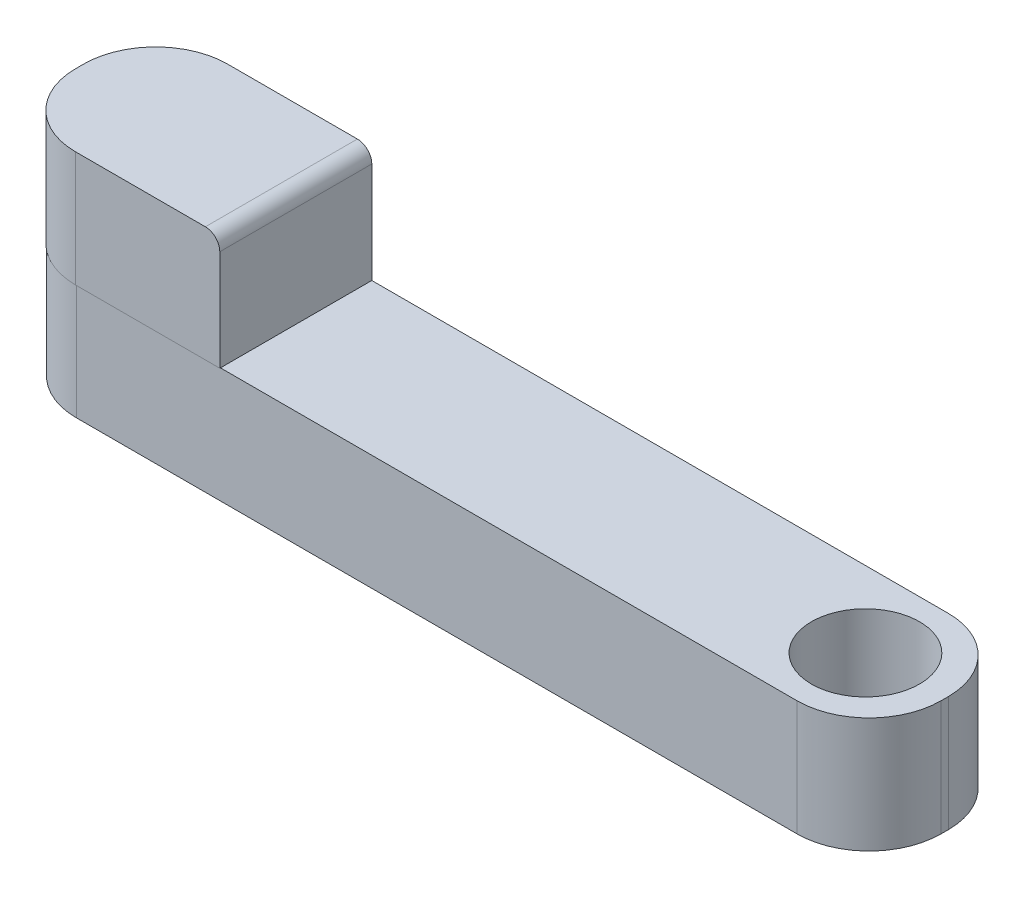
ISO-10303-21;
HEADER;
FILE_DESCRIPTION(('STEP AP214'),'2;1');
FILE_NAME('part.step','',(''),(''),'','','');
FILE_SCHEMA(('AUTOMOTIVE_DESIGN { 1 0 10303 214 1 1 1 1 }'));
ENDSEC;
DATA;
#1=APPLICATION_CONTEXT('core data for automotive mechanical design processes');
#2=APPLICATION_PROTOCOL_DEFINITION('international standard','automotive_design',2000,#1);
#3=PRODUCT_CONTEXT('',#1,'mechanical');
#4=PRODUCT('Part','Part','',(#3));
#5=PRODUCT_RELATED_PRODUCT_CATEGORY('part','',(#4));
#6=PRODUCT_DEFINITION_FORMATION('','',#4);
#7=PRODUCT_DEFINITION_CONTEXT('part definition',#1,'design');
#8=PRODUCT_DEFINITION('design','',#6,#7);
#9=PRODUCT_DEFINITION_SHAPE('','',#8);
#10=(LENGTH_UNIT() NAMED_UNIT(*) SI_UNIT(.MILLI.,.METRE.));
#11=(NAMED_UNIT(*) PLANE_ANGLE_UNIT() SI_UNIT($,.RADIAN.));
#12=(NAMED_UNIT(*) SI_UNIT($,.STERADIAN.) SOLID_ANGLE_UNIT());
#13=UNCERTAINTY_MEASURE_WITH_UNIT(LENGTH_MEASURE(1.E-05),#10,'distance_accuracy_value','');
#14=(GEOMETRIC_REPRESENTATION_CONTEXT(3) GLOBAL_UNCERTAINTY_ASSIGNED_CONTEXT((#13)) GLOBAL_UNIT_ASSIGNED_CONTEXT((#10,
#11,#12)) REPRESENTATION_CONTEXT('',''));
#15=CARTESIAN_POINT('',(0.,0.,0.));
#16=DIRECTION('',(0.,0.,1.));
#17=DIRECTION('',(1.,0.,0.));
#18=AXIS2_PLACEMENT_3D('',#15,#16,#17);
#19=CARTESIAN_POINT('',(-250.,80.,-2.49999999999998));
#20=DIRECTION('',(0.,1.,0.));
#21=DIRECTION('',(0.,0.,1.));
#22=AXIS2_PLACEMENT_3D('',#19,#20,#21);
#23=CYLINDRICAL_SURFACE('',#22,50.);
#24=DIRECTION('',(0.,1.,0.));
#25=VECTOR('',#24,1.);
#26=CARTESIAN_POINT('',(-250.,80.,-52.5));
#27=LINE('',#26,#25);
#28=CARTESIAN_POINT('',(-250.,0.,-52.5));
#29=VERTEX_POINT('',#28);
#30=CARTESIAN_POINT('',(-250.,160.,-52.5));
#31=VERTEX_POINT('',#30);
#32=EDGE_CURVE('E233',#29,#31,#27,.T.);
#33=ORIENTED_EDGE('',*,*,#32,.F.);
#34=CARTESIAN_POINT('',(-250.,0.,-2.49999999999998));
#35=DIRECTION('',(0.,1.,0.));
#36=DIRECTION('',(0.,0.,1.));
#37=AXIS2_PLACEMENT_3D('',#34,#35,#36);
#38=CIRCLE('',#37,50.);
#39=CARTESIAN_POINT('',(-300.,0.,-2.49999999999998));
#40=VERTEX_POINT('',#39);
#41=EDGE_CURVE('E40',#40,#29,#38,.F.);
#42=ORIENTED_EDGE('',*,*,#41,.F.);
#43=DIRECTION('',(0.,1.,0.));
#44=VECTOR('',#43,1.);
#45=CARTESIAN_POINT('',(-300.,80.,-2.49999999999998));
#46=LINE('',#45,#44);
#47=CARTESIAN_POINT('',(-300.,160.,-2.49999999999998));
#48=VERTEX_POINT('',#47);
#49=EDGE_CURVE('E236',#48,#40,#46,.F.);
#50=ORIENTED_EDGE('',*,*,#49,.F.);
#51=CARTESIAN_POINT('',(-250.,160.,-2.49999999999998));
#52=DIRECTION('',(0.,1.,0.));
#53=DIRECTION('',(0.,0.,1.));
#54=AXIS2_PLACEMENT_3D('',#51,#52,#53);
#55=CIRCLE('',#54,50.);
#56=EDGE_CURVE('E11',#31,#48,#55,.T.);
#57=ORIENTED_EDGE('',*,*,#56,.F.);
#58=EDGE_LOOP('',(#33,#42,#50,#57));
#59=FACE_BOUND('',#58,.T.);
#60=ADVANCED_FACE('F33',(#59),#23,.T.);
#61=CARTESIAN_POINT('',(-250.,80.,2.95758635943613));
#62=DIRECTION('',(0.,1.,0.));
#63=DIRECTION('',(0.,0.,1.));
#64=AXIS2_PLACEMENT_3D('',#61,#62,#63);
#65=CYLINDRICAL_SURFACE('',#64,50.);
#66=DIRECTION('',(0.,1.,0.));
#67=VECTOR('',#66,1.);
#68=CARTESIAN_POINT('',(-300.,80.,2.95758635943613));
#69=LINE('',#68,#67);
#70=CARTESIAN_POINT('',(-300.,80.,2.95758635943613));
#71=VERTEX_POINT('',#70);
#72=CARTESIAN_POINT('',(-300.,160.,2.95758635943613));
#73=VERTEX_POINT('',#72);
#74=EDGE_CURVE('E225',#71,#73,#69,.T.);
#75=ORIENTED_EDGE('',*,*,#74,.F.);
#76=CARTESIAN_POINT('',(-250.,80.,2.95758635943613));
#77=DIRECTION('',(0.,1.,0.));
#78=DIRECTION('',(0.,0.,1.));
#79=AXIS2_PLACEMENT_3D('',#76,#77,#78);
#80=CIRCLE('',#79,50.);
#81=CARTESIAN_POINT('',(-250.,80.,52.9575863594361));
#82=VERTEX_POINT('',#81);
#83=EDGE_CURVE('E229',#82,#71,#80,.F.);
#84=ORIENTED_EDGE('',*,*,#83,.F.);
#85=DIRECTION('',(0.,1.,0.));
#86=VECTOR('',#85,1.);
#87=CARTESIAN_POINT('',(-250.,160.,52.9575863594361));
#88=LINE('',#87,#86);
#89=CARTESIAN_POINT('',(-250.,160.,52.9575863594361));
#90=VERTEX_POINT('',#89);
#91=EDGE_CURVE('E135',#90,#82,#88,.F.);
#92=ORIENTED_EDGE('',*,*,#91,.F.);
#93=CARTESIAN_POINT('',(-250.,160.,2.95758635943613));
#94=DIRECTION('',(0.,1.,0.));
#95=DIRECTION('',(0.,0.,1.));
#96=AXIS2_PLACEMENT_3D('',#93,#94,#95);
#97=CIRCLE('',#96,50.);
#98=EDGE_CURVE('E231',#73,#90,#97,.T.);
#99=ORIENTED_EDGE('',*,*,#98,.F.);
#100=EDGE_LOOP('',(#75,#84,#92,#99));
#101=FACE_BOUND('',#100,.T.);
#102=ADVANCED_FACE('F298',(#101),#65,.T.);
#103=CARTESIAN_POINT('',(-250.,80.,2.49999999999998));
#104=DIRECTION('',(0.,1.,0.));
#105=DIRECTION('',(0.,0.,1.));
#106=AXIS2_PLACEMENT_3D('',#103,#104,#105);
#107=CYLINDRICAL_SURFACE('',#106,50.);
#108=DIRECTION('',(0.,1.,0.));
#109=VECTOR('',#108,1.);
#110=CARTESIAN_POINT('',(-300.,80.,2.49999999999998));
#111=LINE('',#110,#109);
#112=CARTESIAN_POINT('',(-300.,0.,2.49999999999998));
#113=VERTEX_POINT('',#112);
#114=CARTESIAN_POINT('',(-300.,80.,2.49999999999998));
#115=VERTEX_POINT('',#114);
#116=EDGE_CURVE('E213',#113,#115,#111,.T.);
#117=ORIENTED_EDGE('',*,*,#116,.F.);
#118=CARTESIAN_POINT('',(-250.,0.,2.49999999999998));
#119=DIRECTION('',(0.,1.,0.));
#120=DIRECTION('',(0.,0.,1.));
#121=AXIS2_PLACEMENT_3D('',#118,#119,#120);
#122=CIRCLE('',#121,50.);
#123=CARTESIAN_POINT('',(-250.,0.,52.5));
#124=VERTEX_POINT('',#123);
#125=EDGE_CURVE('E219',#124,#113,#122,.F.);
#126=ORIENTED_EDGE('',*,*,#125,.F.);
#127=DIRECTION('',(0.,1.,0.));
#128=VECTOR('',#127,1.);
#129=CARTESIAN_POINT('',(-250.,80.,52.5));
#130=LINE('',#129,#128);
#131=CARTESIAN_POINT('',(-250.,80.,52.5));
#132=VERTEX_POINT('',#131);
#133=EDGE_CURVE('E216',#132,#124,#130,.F.);
#134=ORIENTED_EDGE('',*,*,#133,.F.);
#135=CARTESIAN_POINT('',(-250.,80.,2.49999999999998));
#136=DIRECTION('',(0.,1.,0.));
#137=DIRECTION('',(0.,0.,1.));
#138=AXIS2_PLACEMENT_3D('',#135,#136,#137);
#139=CIRCLE('',#138,50.);
#140=EDGE_CURVE('E222',#132,#115,#139,.F.);
#141=ORIENTED_EDGE('',*,*,#140,.T.);
#142=EDGE_LOOP('',(#117,#126,#134,#141));
#143=FACE_BOUND('',#142,.T.);
#144=ADVANCED_FACE('F302',(#143),#107,.T.);
#145=CARTESIAN_POINT('',(250.,80.,-2.49999999999997));
#146=DIRECTION('',(0.,-1.,0.));
#147=DIRECTION('',(0.,0.,-1.));
#148=AXIS2_PLACEMENT_3D('',#145,#146,#147);
#149=CYLINDRICAL_SURFACE('',#148,50.);
#150=DIRECTION('',(0.,-1.,0.));
#151=VECTOR('',#150,1.);
#152=CARTESIAN_POINT('',(250.,80.,-52.5));
#153=LINE('',#152,#151);
#154=CARTESIAN_POINT('',(250.,80.,-52.5));
#155=VERTEX_POINT('',#154);
#156=CARTESIAN_POINT('',(250.,0.,-52.5));
#157=VERTEX_POINT('',#156);
#158=EDGE_CURVE('E203',#155,#157,#153,.T.);
#159=ORIENTED_EDGE('',*,*,#158,.F.);
#160=CARTESIAN_POINT('',(250.,80.,-2.49999999999997));
#161=DIRECTION('',(0.,1.,0.));
#162=DIRECTION('',(0.,0.,1.));
#163=AXIS2_PLACEMENT_3D('',#160,#161,#162);
#164=CIRCLE('',#163,50.);
#165=CARTESIAN_POINT('',(300.,80.,-2.49999999999997));
#166=VERTEX_POINT('',#165);
#167=EDGE_CURVE('E209',#166,#155,#164,.T.);
#168=ORIENTED_EDGE('',*,*,#167,.F.);
#169=DIRECTION('',(0.,-1.,0.));
#170=VECTOR('',#169,1.);
#171=CARTESIAN_POINT('',(300.,80.,-2.49999999999997));
#172=LINE('',#171,#170);
#173=CARTESIAN_POINT('',(300.,0.,-2.49999999999997));
#174=VERTEX_POINT('',#173);
#175=EDGE_CURVE('E206',#174,#166,#172,.F.);
#176=ORIENTED_EDGE('',*,*,#175,.F.);
#177=CARTESIAN_POINT('',(250.,0.,-2.49999999999997));
#178=DIRECTION('',(0.,1.,0.));
#179=DIRECTION('',(0.,0.,1.));
#180=AXIS2_PLACEMENT_3D('',#177,#178,#179);
#181=CIRCLE('',#180,50.);
#182=EDGE_CURVE('E211',#157,#174,#181,.F.);
#183=ORIENTED_EDGE('',*,*,#182,.F.);
#184=EDGE_LOOP('',(#159,#168,#176,#183));
#185=FACE_BOUND('',#184,.T.);
#186=ADVANCED_FACE('F249',(#185),#149,.T.);
#187=CARTESIAN_POINT('',(250.,80.,2.50000000000002));
#188=DIRECTION('',(0.,1.,0.));
#189=DIRECTION('',(0.,0.,1.));
#190=AXIS2_PLACEMENT_3D('',#187,#188,#189);
#191=CYLINDRICAL_SURFACE('',#190,50.);
#192=DIRECTION('',(0.,1.,0.));
#193=VECTOR('',#192,1.);
#194=CARTESIAN_POINT('',(250.,80.,52.5));
#195=LINE('',#194,#193);
#196=CARTESIAN_POINT('',(250.,0.,52.5));
#197=VERTEX_POINT('',#196);
#198=CARTESIAN_POINT('',(250.,80.,52.5));
#199=VERTEX_POINT('',#198);
#200=EDGE_CURVE('E192',#197,#199,#195,.T.);
#201=ORIENTED_EDGE('',*,*,#200,.F.);
#202=CARTESIAN_POINT('',(250.,0.,2.50000000000002));
#203=DIRECTION('',(0.,1.,0.));
#204=DIRECTION('',(0.,0.,1.));
#205=AXIS2_PLACEMENT_3D('',#202,#203,#204);
#206=CIRCLE('',#205,50.);
#207=CARTESIAN_POINT('',(300.,0.,2.50000000000002));
#208=VERTEX_POINT('',#207);
#209=EDGE_CURVE('E198',#208,#197,#206,.F.);
#210=ORIENTED_EDGE('',*,*,#209,.F.);
#211=DIRECTION('',(0.,1.,0.));
#212=VECTOR('',#211,1.);
#213=CARTESIAN_POINT('',(300.,80.,2.50000000000002));
#214=LINE('',#213,#212);
#215=CARTESIAN_POINT('',(300.,80.,2.50000000000002));
#216=VERTEX_POINT('',#215);
#217=EDGE_CURVE('E195',#216,#208,#214,.F.);
#218=ORIENTED_EDGE('',*,*,#217,.F.);
#219=CARTESIAN_POINT('',(250.,80.,2.50000000000002));
#220=DIRECTION('',(0.,1.,0.));
#221=DIRECTION('',(0.,0.,1.));
#222=AXIS2_PLACEMENT_3D('',#219,#220,#221);
#223=CIRCLE('',#222,50.);
#224=EDGE_CURVE('E201',#199,#216,#223,.T.);
#225=ORIENTED_EDGE('',*,*,#224,.F.);
#226=EDGE_LOOP('',(#201,#210,#218,#225));
#227=FACE_BOUND('',#226,.T.);
#228=ADVANCED_FACE('F260',(#227),#191,.T.);
#229=CARTESIAN_POINT('',(-160.,150.,0.));
#230=DIRECTION('',(0.,0.,1.));
#231=DIRECTION('',(1.,0.,0.));
#232=AXIS2_PLACEMENT_3D('',#229,#230,#231);
#233=CYLINDRICAL_SURFACE('',#232,10.);
#234=DIRECTION('',(0.,0.,-1.));
#235=VECTOR('',#234,1.);
#236=CARTESIAN_POINT('',(-160.,160.,0.));
#237=LINE('',#236,#235);
#238=CARTESIAN_POINT('',(-160.,160.,52.9575863594361));
#239=VERTEX_POINT('',#238);
#240=CARTESIAN_POINT('',(-160.,160.,-52.5));
#241=VERTEX_POINT('',#240);
#242=EDGE_CURVE('E164',#239,#241,#237,.T.);
#243=ORIENTED_EDGE('',*,*,#242,.F.);
#244=CARTESIAN_POINT('',(-160.,150.,52.9575863594361));
#245=DIRECTION('',(0.,0.,-1.));
#246=DIRECTION('',(-1.,0.,0.));
#247=AXIS2_PLACEMENT_3D('',#244,#245,#246);
#248=CIRCLE('',#247,10.);
#249=CARTESIAN_POINT('',(-150.,150.,52.9575863594361));
#250=VERTEX_POINT('',#249);
#251=EDGE_CURVE('E188',#250,#239,#248,.F.);
#252=ORIENTED_EDGE('',*,*,#251,.F.);
#253=DIRECTION('',(0.,0.,-1.));
#254=VECTOR('',#253,1.);
#255=CARTESIAN_POINT('',(-150.,150.,0.));
#256=LINE('',#255,#254);
#257=CARTESIAN_POINT('',(-150.,150.,-52.5));
#258=VERTEX_POINT('',#257);
#259=EDGE_CURVE('E148',#258,#250,#256,.F.);
#260=ORIENTED_EDGE('',*,*,#259,.F.);
#261=CARTESIAN_POINT('',(-160.,150.,-52.5));
#262=DIRECTION('',(0.,0.,1.));
#263=DIRECTION('',(1.,0.,0.));
#264=AXIS2_PLACEMENT_3D('',#261,#262,#263);
#265=CIRCLE('',#264,10.);
#266=EDGE_CURVE('E190',#241,#258,#265,.F.);
#267=ORIENTED_EDGE('',*,*,#266,.F.);
#268=EDGE_LOOP('',(#243,#252,#260,#267));
#269=FACE_BOUND('',#268,.T.);
#270=ADVANCED_FACE('F315',(#269),#233,.T.);
#271=CARTESIAN_POINT('',(0.,80.,0.));
#272=DIRECTION('',(0.,1.,0.));
#273=DIRECTION('',(0.,0.,1.));
#274=AXIS2_PLACEMENT_3D('',#271,#272,#273);
#275=PLANE('',#274);
#276=DIRECTION('',(0.,0.,-1.));
#277=VECTOR('',#276,1.);
#278=CARTESIAN_POINT('',(300.,80.,-52.5));
#279=LINE('',#278,#277);
#280=EDGE_CURVE('E183',#216,#166,#279,.T.);
#281=ORIENTED_EDGE('',*,*,#280,.T.);
#282=ORIENTED_EDGE('',*,*,#167,.T.);
#283=DIRECTION('',(-1.,0.,0.));
#284=VECTOR('',#283,1.);
#285=CARTESIAN_POINT('',(-300.,80.,-52.5));
#286=LINE('',#285,#284);
#287=CARTESIAN_POINT('',(-150.,80.,-52.5));
#288=VERTEX_POINT('',#287);
#289=EDGE_CURVE('E169',#155,#288,#286,.T.);
#290=ORIENTED_EDGE('',*,*,#289,.T.);
#291=DIRECTION('',(0.,0.,-1.));
#292=VECTOR('',#291,1.);
#293=CARTESIAN_POINT('',(-150.,80.,-52.5));
#294=LINE('',#293,#292);
#295=CARTESIAN_POINT('',(-150.,80.,52.5));
#296=VERTEX_POINT('',#295);
#297=EDGE_CURVE('E158',#296,#288,#294,.T.);
#298=ORIENTED_EDGE('',*,*,#297,.F.);
#299=DIRECTION('',(1.,0.,0.));
#300=VECTOR('',#299,1.);
#301=CARTESIAN_POINT('',(-300.,80.,52.5));
#302=LINE('',#301,#300);
#303=EDGE_CURVE('E166',#296,#199,#302,.T.);
#304=ORIENTED_EDGE('',*,*,#303,.T.);
#305=ORIENTED_EDGE('',*,*,#224,.T.);
#306=EDGE_LOOP('',(#281,#282,#290,#298,#304,#305));
#307=FACE_BOUND('',#306,.T.);
#308=CARTESIAN_POINT('',(245.,80.,0.));
#309=DIRECTION('',(0.,1.,0.));
#310=DIRECTION('',(0.,0.,1.));
#311=AXIS2_PLACEMENT_3D('',#308,#309,#310);
#312=CIRCLE('',#311,37.5);
#313=CARTESIAN_POINT('',(245.,80.,37.5));
#314=VERTEX_POINT('',#313);
#315=EDGE_CURVE('E270',#314,#314,#312,.T.);
#316=ORIENTED_EDGE('',*,*,#315,.F.);
#317=EDGE_LOOP('',(#316));
#318=FACE_BOUND('',#317,.T.);
#319=ADVANCED_FACE('F265',(#307,#318),#275,.T.);
#320=CARTESIAN_POINT('',(0.,0.,0.));
#321=DIRECTION('',(0.,1.,0.));
#322=DIRECTION('',(0.,0.,1.));
#323=AXIS2_PLACEMENT_3D('',#320,#321,#322);
#324=PLANE('',#323);
#325=DIRECTION('',(0.,0.,1.));
#326=VECTOR('',#325,1.);
#327=CARTESIAN_POINT('',(-300.,0.,-52.5));
#328=LINE('',#327,#326);
#329=EDGE_CURVE('E180',#40,#113,#328,.T.);
#330=ORIENTED_EDGE('',*,*,#329,.F.);
#331=ORIENTED_EDGE('',*,*,#41,.T.);
#332=DIRECTION('',(-1.,0.,0.));
#333=VECTOR('',#332,1.);
#334=CARTESIAN_POINT('',(-300.,0.,-52.5));
#335=LINE('',#334,#333);
#336=EDGE_CURVE('E176',#157,#29,#335,.T.);
#337=ORIENTED_EDGE('',*,*,#336,.F.);
#338=ORIENTED_EDGE('',*,*,#182,.T.);
#339=DIRECTION('',(0.,0.,-1.));
#340=VECTOR('',#339,1.);
#341=CARTESIAN_POINT('',(300.,0.,-52.5));
#342=LINE('',#341,#340);
#343=EDGE_CURVE('E173',#208,#174,#342,.T.);
#344=ORIENTED_EDGE('',*,*,#343,.F.);
#345=ORIENTED_EDGE('',*,*,#209,.T.);
#346=DIRECTION('',(1.,0.,0.));
#347=VECTOR('',#346,1.);
#348=CARTESIAN_POINT('',(-300.,0.,52.5));
#349=LINE('',#348,#347);
#350=EDGE_CURVE('E182',#124,#197,#349,.T.);
#351=ORIENTED_EDGE('',*,*,#350,.F.);
#352=ORIENTED_EDGE('',*,*,#125,.T.);
#353=EDGE_LOOP('',(#330,#331,#337,#338,#344,#345,#351,#352));
#354=FACE_BOUND('',#353,.T.);
#355=CARTESIAN_POINT('',(-245.,0.,0.));
#356=DIRECTION('',(0.,1.,0.));
#357=DIRECTION('',(0.,0.,1.));
#358=AXIS2_PLACEMENT_3D('',#355,#356,#357);
#359=CIRCLE('',#358,50.);
#360=CARTESIAN_POINT('',(-245.,0.,50.));
#361=VERTEX_POINT('',#360);
#362=EDGE_CURVE('E177',#361,#361,#359,.T.);
#363=ORIENTED_EDGE('',*,*,#362,.T.);
#364=EDGE_LOOP('',(#363));
#365=FACE_BOUND('',#364,.T.);
#366=CARTESIAN_POINT('',(245.,0.,0.));
#367=DIRECTION('',(0.,1.,0.));
#368=DIRECTION('',(0.,0.,1.));
#369=AXIS2_PLACEMENT_3D('',#366,#367,#368);
#370=CIRCLE('',#369,37.5);
#371=CARTESIAN_POINT('',(245.,0.,37.5));
#372=VERTEX_POINT('',#371);
#373=EDGE_CURVE('E273',#372,#372,#370,.T.);
#374=ORIENTED_EDGE('',*,*,#373,.T.);
#375=EDGE_LOOP('',(#374));
#376=FACE_BOUND('',#375,.T.);
#377=ADVANCED_FACE('F240',(#354,#365,#376),#324,.F.);
#378=CARTESIAN_POINT('',(300.,80.,-52.5));
#379=DIRECTION('',(-1.,0.,0.));
#380=DIRECTION('',(0.,0.,1.));
#381=AXIS2_PLACEMENT_3D('',#378,#379,#380);
#382=PLANE('',#381);
#383=ORIENTED_EDGE('',*,*,#343,.T.);
#384=ORIENTED_EDGE('',*,*,#175,.T.);
#385=ORIENTED_EDGE('',*,*,#280,.F.);
#386=ORIENTED_EDGE('',*,*,#217,.T.);
#387=EDGE_LOOP('',(#383,#384,#385,#386));
#388=FACE_BOUND('',#387,.T.);
#389=ADVANCED_FACE('F255',(#388),#382,.F.);
#390=CARTESIAN_POINT('',(-300.,80.,-52.5));
#391=DIRECTION('',(0.,0.,1.));
#392=DIRECTION('',(1.,0.,0.));
#393=AXIS2_PLACEMENT_3D('',#390,#391,#392);
#394=PLANE('',#393);
#395=ORIENTED_EDGE('',*,*,#336,.T.);
#396=ORIENTED_EDGE('',*,*,#32,.T.);
#397=DIRECTION('',(-1.,0.,0.));
#398=VECTOR('',#397,1.);
#399=CARTESIAN_POINT('',(-300.,160.,-52.5));
#400=LINE('',#399,#398);
#401=EDGE_CURVE('E267',#241,#31,#400,.T.);
#402=ORIENTED_EDGE('',*,*,#401,.F.);
#403=ORIENTED_EDGE('',*,*,#266,.T.);
#404=DIRECTION('',(0.,-1.,0.));
#405=VECTOR('',#404,1.);
#406=CARTESIAN_POINT('',(-150.,160.,-52.5));
#407=LINE('',#406,#405);
#408=EDGE_CURVE('E150',#258,#288,#407,.T.);
#409=ORIENTED_EDGE('',*,*,#408,.T.);
#410=ORIENTED_EDGE('',*,*,#289,.F.);
#411=ORIENTED_EDGE('',*,*,#158,.T.);
#412=EDGE_LOOP('',(#395,#396,#402,#403,#409,#410,#411));
#413=FACE_BOUND('',#412,.T.);
#414=ADVANCED_FACE('F244',(#413),#394,.F.);
#415=CARTESIAN_POINT('',(-300.,80.,-52.5));
#416=DIRECTION('',(1.,0.,0.));
#417=DIRECTION('',(0.,0.,-1.));
#418=AXIS2_PLACEMENT_3D('',#415,#416,#417);
#419=PLANE('',#418);
#420=DIRECTION('',(0.,0.,1.));
#421=VECTOR('',#420,1.);
#422=CARTESIAN_POINT('',(-300.,160.,-52.5));
#423=LINE('',#422,#421);
#424=EDGE_CURVE('E156',#48,#73,#423,.T.);
#425=ORIENTED_EDGE('',*,*,#424,.F.);
#426=ORIENTED_EDGE('',*,*,#49,.T.);
#427=ORIENTED_EDGE('',*,*,#329,.T.);
#428=ORIENTED_EDGE('',*,*,#116,.T.);
#429=DIRECTION('',(0.,0.,1.));
#430=VECTOR('',#429,1.);
#431=CARTESIAN_POINT('',(-300.,80.,-52.5));
#432=LINE('',#431,#430);
#433=EDGE_CURVE('E139',#115,#71,#432,.T.);
#434=ORIENTED_EDGE('',*,*,#433,.T.);
#435=ORIENTED_EDGE('',*,*,#74,.T.);
#436=EDGE_LOOP('',(#425,#426,#427,#428,#434,#435));
#437=FACE_BOUND('',#436,.T.);
#438=ADVANCED_FACE('F294',(#437),#419,.F.);
#439=CARTESIAN_POINT('',(-300.,80.,52.5));
#440=DIRECTION('',(0.,0.,-1.));
#441=DIRECTION('',(-1.,0.,0.));
#442=AXIS2_PLACEMENT_3D('',#439,#440,#441);
#443=PLANE('',#442);
#444=EDGE_CURVE('E154',#132,#296,#302,.T.);
#445=ORIENTED_EDGE('',*,*,#444,.F.);
#446=ORIENTED_EDGE('',*,*,#133,.T.);
#447=ORIENTED_EDGE('',*,*,#350,.T.);
#448=ORIENTED_EDGE('',*,*,#200,.T.);
#449=ORIENTED_EDGE('',*,*,#303,.F.);
#450=EDGE_LOOP('',(#445,#446,#447,#448,#449));
#451=FACE_BOUND('',#450,.T.);
#452=ADVANCED_FACE('F263',(#451),#443,.F.);
#453=CARTESIAN_POINT('',(-245.,80.,0.));
#454=DIRECTION('',(0.,-1.,0.));
#455=DIRECTION('',(0.,0.,-1.));
#456=AXIS2_PLACEMENT_3D('',#453,#454,#455);
#457=CYLINDRICAL_SURFACE('',#456,50.);
#458=CARTESIAN_POINT('',(-245.,80.,0.));
#459=DIRECTION('',(0.,1.,0.));
#460=DIRECTION('',(0.,0.,1.));
#461=AXIS2_PLACEMENT_3D('',#458,#459,#460);
#462=CIRCLE('',#461,50.);
#463=CARTESIAN_POINT('',(-245.,80.,50.));
#464=VERTEX_POINT('',#463);
#465=EDGE_CURVE('E149',#464,#464,#462,.T.);
#466=ORIENTED_EDGE('',*,*,#465,.T.);
#467=EDGE_LOOP('',(#466));
#468=FACE_BOUND('',#467,.T.);
#469=ORIENTED_EDGE('',*,*,#362,.F.);
#470=EDGE_LOOP('',(#469));
#471=FACE_BOUND('',#470,.T.);
#472=ADVANCED_FACE('F282',(#468,#471),#457,.F.);
#473=CARTESIAN_POINT('',(245.,80.,0.));
#474=DIRECTION('',(0.,-1.,0.));
#475=DIRECTION('',(0.,0.,-1.));
#476=AXIS2_PLACEMENT_3D('',#473,#474,#475);
#477=CYLINDRICAL_SURFACE('',#476,37.5);
#478=ORIENTED_EDGE('',*,*,#315,.T.);
#479=EDGE_LOOP('',(#478));
#480=FACE_BOUND('',#479,.T.);
#481=ORIENTED_EDGE('',*,*,#373,.F.);
#482=EDGE_LOOP('',(#481));
#483=FACE_BOUND('',#482,.T.);
#484=ADVANCED_FACE('F284',(#480,#483),#477,.F.);
#485=CARTESIAN_POINT('',(0.,160.,0.));
#486=DIRECTION('',(0.,1.,0.));
#487=DIRECTION('',(0.,0.,1.));
#488=AXIS2_PLACEMENT_3D('',#485,#486,#487);
#489=PLANE('',#488);
#490=ORIENTED_EDGE('',*,*,#401,.T.);
#491=ORIENTED_EDGE('',*,*,#56,.T.);
#492=ORIENTED_EDGE('',*,*,#424,.T.);
#493=ORIENTED_EDGE('',*,*,#98,.T.);
#494=DIRECTION('',(1.,0.,0.));
#495=VECTOR('',#494,1.);
#496=CARTESIAN_POINT('',(-300.,160.,52.9575863594361));
#497=LINE('',#496,#495);
#498=EDGE_CURVE('E159',#90,#239,#497,.T.);
#499=ORIENTED_EDGE('',*,*,#498,.T.);
#500=ORIENTED_EDGE('',*,*,#242,.T.);
#501=EDGE_LOOP('',(#490,#491,#492,#493,#499,#500));
#502=FACE_BOUND('',#501,.T.);
#503=ADVANCED_FACE('F291',(#502),#489,.T.);
#504=CARTESIAN_POINT('',(-150.,160.,-52.5));
#505=DIRECTION('',(-1.,0.,0.));
#506=DIRECTION('',(0.,0.,1.));
#507=AXIS2_PLACEMENT_3D('',#504,#505,#506);
#508=PLANE('',#507);
#509=ORIENTED_EDGE('',*,*,#408,.F.);
#510=ORIENTED_EDGE('',*,*,#259,.T.);
#511=DIRECTION('',(0.,-1.,0.));
#512=VECTOR('',#511,1.);
#513=CARTESIAN_POINT('',(-150.,160.,52.9575863594361));
#514=LINE('',#513,#512);
#515=CARTESIAN_POINT('',(-150.,80.,52.9575863594361));
#516=VERTEX_POINT('',#515);
#517=EDGE_CURVE('E133',#250,#516,#514,.T.);
#518=ORIENTED_EDGE('',*,*,#517,.T.);
#519=EDGE_CURVE('E138',#516,#296,#294,.T.);
#520=ORIENTED_EDGE('',*,*,#519,.T.);
#521=ORIENTED_EDGE('',*,*,#297,.T.);
#522=EDGE_LOOP('',(#509,#510,#518,#520,#521));
#523=FACE_BOUND('',#522,.T.);
#524=ADVANCED_FACE('F145',(#523),#508,.F.);
#525=CARTESIAN_POINT('',(-300.,160.,52.9575863594361));
#526=DIRECTION('',(0.,0.,-1.));
#527=DIRECTION('',(-1.,0.,0.));
#528=AXIS2_PLACEMENT_3D('',#525,#526,#527);
#529=PLANE('',#528);
#530=ORIENTED_EDGE('',*,*,#498,.F.);
#531=ORIENTED_EDGE('',*,*,#91,.T.);
#532=DIRECTION('',(1.,0.,0.));
#533=VECTOR('',#532,1.);
#534=CARTESIAN_POINT('',(-300.,80.,52.9575863594361));
#535=LINE('',#534,#533);
#536=EDGE_CURVE('E128',#82,#516,#535,.T.);
#537=ORIENTED_EDGE('',*,*,#536,.T.);
#538=ORIENTED_EDGE('',*,*,#517,.F.);
#539=ORIENTED_EDGE('',*,*,#251,.T.);
#540=EDGE_LOOP('',(#530,#531,#537,#538,#539));
#541=FACE_BOUND('',#540,.T.);
#542=ADVANCED_FACE('F131',(#541),#529,.F.);
#543=CARTESIAN_POINT('',(0.,80.,0.));
#544=DIRECTION('',(0.,1.,0.));
#545=DIRECTION('',(0.,0.,1.));
#546=AXIS2_PLACEMENT_3D('',#543,#544,#545);
#547=PLANE('',#546);
#548=ORIENTED_EDGE('',*,*,#536,.F.);
#549=ORIENTED_EDGE('',*,*,#83,.T.);
#550=ORIENTED_EDGE('',*,*,#433,.F.);
#551=ORIENTED_EDGE('',*,*,#140,.F.);
#552=ORIENTED_EDGE('',*,*,#444,.T.);
#553=ORIENTED_EDGE('',*,*,#519,.F.);
#554=EDGE_LOOP('',(#548,#549,#550,#551,#552,#553));
#555=FACE_BOUND('',#554,.T.);
#556=ADVANCED_FACE('F152',(#555),#547,.F.);
#557=CARTESIAN_POINT('',(-245.135702484109,80.,0.));
#558=DIRECTION('',(0.,1.,0.));
#559=DIRECTION('',(0.,0.,1.));
#560=AXIS2_PLACEMENT_3D('',#557,#558,#559);
#561=CIRCLE('',#560,4.99999999999999);
#562=CARTESIAN_POINT('',(-245.135702484109,80.,4.99999999999999));
#563=VERTEX_POINT('',#562);
#564=EDGE_CURVE('E162',#563,#563,#561,.F.);
#565=ORIENTED_EDGE('',*,*,#564,.F.);
#566=EDGE_LOOP('',(#565));
#567=FACE_BOUND('',#566,.T.);
#568=ORIENTED_EDGE('',*,*,#465,.F.);
#569=EDGE_LOOP('',(#568));
#570=FACE_BOUND('',#569,.T.);
#571=ADVANCED_FACE('F382',(#567,#570),#547,.F.);
#572=CARTESIAN_POINT('',(-245.135702484109,-40.,0.));
#573=DIRECTION('',(0.,1.,0.));
#574=DIRECTION('',(0.,0.,1.));
#575=AXIS2_PLACEMENT_3D('',#572,#573,#574);
#576=CYLINDRICAL_SURFACE('',#575,4.99999999999999);
#577=CARTESIAN_POINT('',(-245.135702484109,-40.,0.));
#578=DIRECTION('',(0.,-1.,0.));
#579=DIRECTION('',(0.,0.,-1.));
#580=AXIS2_PLACEMENT_3D('',#577,#578,#579);
#581=CIRCLE('',#580,4.99999999999999);
#582=CARTESIAN_POINT('',(-245.135702484109,-40.,-4.99999999999999));
#583=VERTEX_POINT('',#582);
#584=EDGE_CURVE('E474',#583,#583,#581,.T.);
#585=ORIENTED_EDGE('',*,*,#584,.F.);
#586=EDGE_LOOP('',(#585));
#587=FACE_BOUND('',#586,.T.);
#588=ORIENTED_EDGE('',*,*,#564,.T.);
#589=EDGE_LOOP('',(#588));
#590=FACE_BOUND('',#589,.T.);
#591=ADVANCED_FACE('F395',(#587,#590),#576,.T.);
#592=CARTESIAN_POINT('',(-245.135702484109,-40.,0.));
#593=DIRECTION('',(0.,-1.,0.));
#594=DIRECTION('',(0.,0.,-1.));
#595=AXIS2_PLACEMENT_3D('',#592,#593,#594);
#596=PLANE('',#595);
#597=ORIENTED_EDGE('',*,*,#584,.T.);
#598=EDGE_LOOP('',(#597));
#599=FACE_BOUND('',#598,.T.);
#600=ADVANCED_FACE('F402',(#599),#596,.T.);
#601=CLOSED_SHELL('',(#60,#102,#144,#186,#228,#270,#319,#377,#389,#414,#438,#452,#472,#484,#503,
#524,#542,#556,#571,#591,#600));
#602=MANIFOLD_SOLID_BREP('B2',#601);
#603=ADVANCED_BREP_SHAPE_REPRESENTATION('',(#18,#602),#14);
#604=SHAPE_DEFINITION_REPRESENTATION(#9,#603);
ENDSEC;
END-ISO-10303-21;
